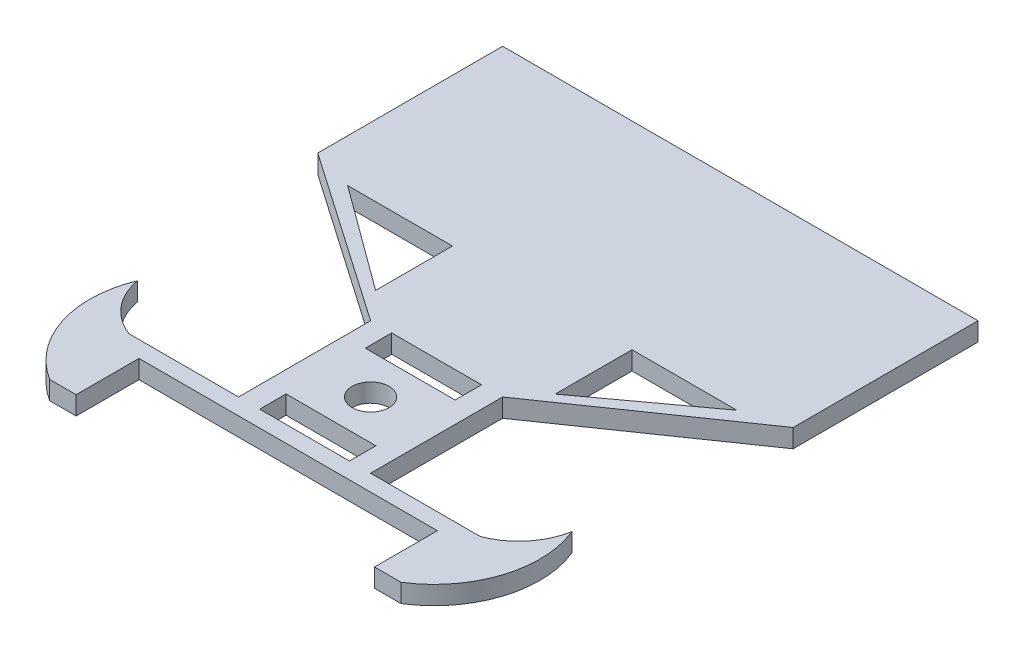
ISO-10303-21;
HEADER;
FILE_DESCRIPTION(('STEP AP214'),'2;1');
FILE_NAME('part.step','',(''),(''),'','','');
FILE_SCHEMA(('AUTOMOTIVE_DESIGN { 1 0 10303 214 1 1 1 1 }'));
ENDSEC;
DATA;
#1=APPLICATION_CONTEXT('core data for automotive mechanical design processes');
#2=APPLICATION_PROTOCOL_DEFINITION('international standard','automotive_design',2000,#1);
#3=PRODUCT_CONTEXT('',#1,'mechanical');
#4=PRODUCT('Part','Part','',(#3));
#5=PRODUCT_RELATED_PRODUCT_CATEGORY('part','',(#4));
#6=PRODUCT_DEFINITION_FORMATION('','',#4);
#7=PRODUCT_DEFINITION_CONTEXT('part definition',#1,'design');
#8=PRODUCT_DEFINITION('design','',#6,#7);
#9=PRODUCT_DEFINITION_SHAPE('','',#8);
#10=(LENGTH_UNIT() NAMED_UNIT(*) SI_UNIT(.MILLI.,.METRE.));
#11=(NAMED_UNIT(*) PLANE_ANGLE_UNIT() SI_UNIT($,.RADIAN.));
#12=(NAMED_UNIT(*) SI_UNIT($,.STERADIAN.) SOLID_ANGLE_UNIT());
#13=UNCERTAINTY_MEASURE_WITH_UNIT(LENGTH_MEASURE(1.E-05),#10,'distance_accuracy_value','');
#14=(GEOMETRIC_REPRESENTATION_CONTEXT(3) GLOBAL_UNCERTAINTY_ASSIGNED_CONTEXT((#13)) GLOBAL_UNIT_ASSIGNED_CONTEXT((#10,
#11,#12)) REPRESENTATION_CONTEXT('',''));
#15=CARTESIAN_POINT('',(0.,0.,0.));
#16=DIRECTION('',(0.,0.,1.));
#17=DIRECTION('',(1.,0.,0.));
#18=AXIS2_PLACEMENT_3D('',#15,#16,#17);
#19=CARTESIAN_POINT('',(-66.5,3.5,195.));
#20=DIRECTION('',(0.,0.,-1.));
#21=DIRECTION('',(-1.,0.,0.));
#22=AXIS2_PLACEMENT_3D('',#19,#20,#21);
#23=PLANE('',#22);
#24=DIRECTION('',(1.,0.,0.));
#25=VECTOR('',#24,1.);
#26=CARTESIAN_POINT('',(-66.5,3.5,195.));
#27=LINE('',#26,#25);
#28=CARTESIAN_POINT('',(56.5,3.5,195.));
#29=VERTEX_POINT('',#28);
#30=CARTESIAN_POINT('',(66.5,3.5,195.));
#31=VERTEX_POINT('',#30);
#32=EDGE_CURVE('E518',#29,#31,#27,.T.);
#33=ORIENTED_EDGE('',*,*,#32,.F.);
#34=DIRECTION('',(0.,1.,0.));
#35=VECTOR('',#34,1.);
#36=CARTESIAN_POINT('',(56.5,-3.5,195.));
#37=LINE('',#36,#35);
#38=CARTESIAN_POINT('',(56.5,-3.5,195.));
#39=VERTEX_POINT('',#38);
#40=EDGE_CURVE('E290',#39,#29,#37,.T.);
#41=ORIENTED_EDGE('',*,*,#40,.F.);
#42=DIRECTION('',(1.,0.,0.));
#43=VECTOR('',#42,1.);
#44=CARTESIAN_POINT('',(-66.5,-3.5,195.));
#45=LINE('',#44,#43);
#46=CARTESIAN_POINT('',(66.5,-3.5,195.));
#47=VERTEX_POINT('',#46);
#48=EDGE_CURVE('E277',#39,#47,#45,.T.);
#49=ORIENTED_EDGE('',*,*,#48,.T.);
#50=DIRECTION('',(0.,-1.,0.));
#51=VECTOR('',#50,1.);
#52=CARTESIAN_POINT('',(66.5,3.5,195.));
#53=LINE('',#52,#51);
#54=EDGE_CURVE('E571',#31,#47,#53,.T.);
#55=ORIENTED_EDGE('',*,*,#54,.F.);
#56=EDGE_LOOP('',(#33,#41,#49,#55));
#57=FACE_BOUND('',#56,.T.);
#58=ADVANCED_FACE('F41',(#57),#23,.F.);
#59=CARTESIAN_POINT('',(0.,3.5,0.));
#60=DIRECTION('',(0.,1.,0.));
#61=DIRECTION('',(0.,0.,1.));
#62=AXIS2_PLACEMENT_3D('',#59,#60,#61);
#63=PLANE('',#62);
#64=DIRECTION('',(0.,0.,-1.));
#65=VECTOR('',#64,1.);
#66=CARTESIAN_POINT('',(56.5,3.5,171.2));
#67=LINE('',#66,#65);
#68=CARTESIAN_POINT('',(56.5,3.5,171.2));
#69=VERTEX_POINT('',#68);
#70=EDGE_CURVE('E257',#29,#69,#67,.T.);
#71=ORIENTED_EDGE('',*,*,#70,.F.);
#72=ORIENTED_EDGE('',*,*,#32,.T.);
#73=CARTESIAN_POINT('',(45.2225000521316,3.5,161.128655238263));
#74=DIRECTION('',(0.,1.,0.));
#75=DIRECTION('',(0.,0.,1.));
#76=AXIS2_PLACEMENT_3D('',#73,#74,#75);
#77=CIRCLE('',#76,40.);
#78=CARTESIAN_POINT('',(82.2688387386572,3.5,146.043271917869));
#79=VERTEX_POINT('',#78);
#80=EDGE_CURVE('E406',#31,#79,#77,.T.);
#81=ORIENTED_EDGE('',*,*,#80,.T.);
#82=CARTESIAN_POINT('',(57.6644436717072,3.5,141.613402462745));
#83=DIRECTION('',(0.,-1.,0.));
#84=DIRECTION('',(0.,0.,1.));
#85=AXIS2_PLACEMENT_3D('',#82,#83,#84);
#86=CIRCLE('',#85,25.);
#87=CARTESIAN_POINT('',(66.5,3.5,165.));
#88=VERTEX_POINT('',#87);
#89=EDGE_CURVE('E462',#79,#88,#86,.T.);
#90=ORIENTED_EDGE('',*,*,#89,.T.);
#91=DIRECTION('',(-1.,0.,0.));
#92=VECTOR('',#91,1.);
#93=CARTESIAN_POINT('',(25.,3.5,165.));
#94=LINE('',#93,#92);
#95=CARTESIAN_POINT('',(25.,3.5,165.));
#96=VERTEX_POINT('',#95);
#97=EDGE_CURVE('E523',#88,#96,#94,.T.);
#98=ORIENTED_EDGE('',*,*,#97,.T.);
#99=DIRECTION('',(0.,0.,-1.));
#100=VECTOR('',#99,1.);
#101=CARTESIAN_POINT('',(25.,3.5,115.));
#102=LINE('',#101,#100);
#103=CARTESIAN_POINT('',(25.,3.5,115.));
#104=VERTEX_POINT('',#103);
#105=EDGE_CURVE('E526',#96,#104,#102,.T.);
#106=ORIENTED_EDGE('',*,*,#105,.T.);
#107=DIRECTION('',(0.822192191643778,0.,-0.569209978830309));
#108=VECTOR('',#107,1.);
#109=CARTESIAN_POINT('',(90.,3.5,70.));
#110=LINE('',#109,#108);
#111=CARTESIAN_POINT('',(90.,3.5,70.));
#112=VERTEX_POINT('',#111);
#113=EDGE_CURVE('E495',#104,#112,#110,.T.);
#114=ORIENTED_EDGE('',*,*,#113,.T.);
#115=DIRECTION('',(0.,0.,-1.));
#116=VECTOR('',#115,1.);
#117=CARTESIAN_POINT('',(90.,3.5,0.));
#118=LINE('',#117,#116);
#119=CARTESIAN_POINT('',(90.,3.5,0.));
#120=VERTEX_POINT('',#119);
#121=EDGE_CURVE('E499',#112,#120,#118,.T.);
#122=ORIENTED_EDGE('',*,*,#121,.T.);
#123=DIRECTION('',(-1.,0.,0.));
#124=VECTOR('',#123,1.);
#125=CARTESIAN_POINT('',(90.,3.5,0.));
#126=LINE('',#125,#124);
#127=CARTESIAN_POINT('',(-90.,3.5,0.));
#128=VERTEX_POINT('',#127);
#129=EDGE_CURVE('E503',#120,#128,#126,.T.);
#130=ORIENTED_EDGE('',*,*,#129,.T.);
#131=DIRECTION('',(0.,0.,1.));
#132=VECTOR('',#131,1.);
#133=CARTESIAN_POINT('',(-90.,3.5,0.));
#134=LINE('',#133,#132);
#135=CARTESIAN_POINT('',(-90.,3.5,70.));
#136=VERTEX_POINT('',#135);
#137=EDGE_CURVE('E506',#128,#136,#134,.T.);
#138=ORIENTED_EDGE('',*,*,#137,.T.);
#139=DIRECTION('',(0.822192191643778,0.,0.569209978830309));
#140=VECTOR('',#139,1.);
#141=CARTESIAN_POINT('',(-90.,3.5,70.));
#142=LINE('',#141,#140);
#143=CARTESIAN_POINT('',(-25.,3.5,115.));
#144=VERTEX_POINT('',#143);
#145=EDGE_CURVE('E509',#136,#144,#142,.T.);
#146=ORIENTED_EDGE('',*,*,#145,.T.);
#147=DIRECTION('',(0.,0.,1.));
#148=VECTOR('',#147,1.);
#149=CARTESIAN_POINT('',(-25.,3.5,115.));
#150=LINE('',#149,#148);
#151=CARTESIAN_POINT('',(-25.,3.5,165.));
#152=VERTEX_POINT('',#151);
#153=EDGE_CURVE('E512',#144,#152,#150,.T.);
#154=ORIENTED_EDGE('',*,*,#153,.T.);
#155=DIRECTION('',(-1.,0.,0.));
#156=VECTOR('',#155,1.);
#157=CARTESIAN_POINT('',(-25.,3.5,165.));
#158=LINE('',#157,#156);
#159=CARTESIAN_POINT('',(-66.5,3.5,165.));
#160=VERTEX_POINT('',#159);
#161=EDGE_CURVE('E515',#152,#160,#158,.T.);
#162=ORIENTED_EDGE('',*,*,#161,.T.);
#163=CARTESIAN_POINT('',(-57.6644436717072,3.5,141.613402462745));
#164=DIRECTION('',(0.,-1.,0.));
#165=DIRECTION('',(0.,0.,-1.));
#166=AXIS2_PLACEMENT_3D('',#163,#164,#165);
#167=CIRCLE('',#166,25.);
#168=CARTESIAN_POINT('',(-82.2688387386573,3.5,146.043271917869));
#169=VERTEX_POINT('',#168);
#170=EDGE_CURVE('E475',#160,#169,#167,.T.);
#171=ORIENTED_EDGE('',*,*,#170,.T.);
#172=CARTESIAN_POINT('',(-45.2225000521316,3.5,161.128655238263));
#173=DIRECTION('',(0.,1.,0.));
#174=DIRECTION('',(0.,0.,-1.));
#175=AXIS2_PLACEMENT_3D('',#172,#173,#174);
#176=CIRCLE('',#175,40.);
#177=CARTESIAN_POINT('',(-66.5,3.5,195.));
#178=VERTEX_POINT('',#177);
#179=EDGE_CURVE('E481',#169,#178,#176,.T.);
#180=ORIENTED_EDGE('',*,*,#179,.T.);
#181=CARTESIAN_POINT('',(-56.5,3.5,195.));
#182=VERTEX_POINT('',#181);
#183=EDGE_CURVE('E519',#178,#182,#27,.T.);
#184=ORIENTED_EDGE('',*,*,#183,.T.);
#185=DIRECTION('',(0.,0.,1.));
#186=VECTOR('',#185,1.);
#187=CARTESIAN_POINT('',(-56.5,3.5,195.));
#188=LINE('',#187,#186);
#189=CARTESIAN_POINT('',(-56.5,3.5,171.2));
#190=VERTEX_POINT('',#189);
#191=EDGE_CURVE('E57',#190,#182,#188,.T.);
#192=ORIENTED_EDGE('',*,*,#191,.F.);
#193=DIRECTION('',(-1.,0.,0.));
#194=VECTOR('',#193,1.);
#195=CARTESIAN_POINT('',(-56.5,3.5,171.2));
#196=LINE('',#195,#194);
#197=EDGE_CURVE('E281',#69,#190,#196,.T.);
#198=ORIENTED_EDGE('',*,*,#197,.F.);
#199=EDGE_LOOP('',(#71,#72,#81,#90,#98,#106,#114,#122,#130,#138,#146,#154,#162,#171,#180,#184,
#192,#198));
#200=FACE_BOUND('',#199,.T.);
#201=DIRECTION('',(0.,0.,-1.));
#202=VECTOR('',#201,1.);
#203=CARTESIAN_POINT('',(-34.,3.5,104.097660067528));
#204=LINE('',#203,#202);
#205=CARTESIAN_POINT('',(-34.,3.5,104.097660067528));
#206=VERTEX_POINT('',#205);
#207=CARTESIAN_POINT('',(-34.,3.5,75.));
#208=VERTEX_POINT('',#207);
#209=EDGE_CURVE('E65',#206,#208,#204,.T.);
#210=ORIENTED_EDGE('',*,*,#209,.F.);
#211=DIRECTION('',(0.806528009731602,0.,0.591195880836784));
#212=VECTOR('',#211,1.);
#213=CARTESIAN_POINT('',(-73.6959427878503,3.5,75.));
#214=LINE('',#213,#212);
#215=CARTESIAN_POINT('',(-73.6959427878503,3.5,75.));
#216=VERTEX_POINT('',#215);
#217=EDGE_CURVE('E304',#216,#206,#214,.T.);
#218=ORIENTED_EDGE('',*,*,#217,.F.);
#219=DIRECTION('',(-1.,0.,0.));
#220=VECTOR('',#219,1.);
#221=CARTESIAN_POINT('',(-34.,3.5,75.));
#222=LINE('',#221,#220);
#223=EDGE_CURVE('E315',#208,#216,#222,.T.);
#224=ORIENTED_EDGE('',*,*,#223,.F.);
#225=EDGE_LOOP('',(#210,#218,#224));
#226=FACE_BOUND('',#225,.T.);
#227=DIRECTION('',(0.806528009731602,0.,-0.591195880836784));
#228=VECTOR('',#227,1.);
#229=CARTESIAN_POINT('',(73.6959427878503,3.5,74.9999999999999));
#230=LINE('',#229,#228);
#231=CARTESIAN_POINT('',(34.,3.5,104.097660067528));
#232=VERTEX_POINT('',#231);
#233=CARTESIAN_POINT('',(73.6959427878503,3.5,74.9999999999999));
#234=VERTEX_POINT('',#233);
#235=EDGE_CURVE('E293',#232,#234,#230,.T.);
#236=ORIENTED_EDGE('',*,*,#235,.F.);
#237=DIRECTION('',(0.,0.,1.));
#238=VECTOR('',#237,1.);
#239=CARTESIAN_POINT('',(34.,3.5,104.097660067528));
#240=LINE('',#239,#238);
#241=CARTESIAN_POINT('',(34.,3.5,74.9999999999999));
#242=VERTEX_POINT('',#241);
#243=EDGE_CURVE('E337',#242,#232,#240,.T.);
#244=ORIENTED_EDGE('',*,*,#243,.F.);
#245=DIRECTION('',(-1.,0.,0.));
#246=VECTOR('',#245,1.);
#247=CARTESIAN_POINT('',(34.,3.5,74.9999999999999));
#248=LINE('',#247,#246);
#249=EDGE_CURVE('E348',#234,#242,#248,.T.);
#250=ORIENTED_EDGE('',*,*,#249,.F.);
#251=EDGE_LOOP('',(#236,#244,#250));
#252=FACE_BOUND('',#251,.T.);
#253=CARTESIAN_POINT('',(0.,3.5,140.));
#254=DIRECTION('',(0.,1.,0.));
#255=DIRECTION('',(0.,0.,1.));
#256=AXIS2_PLACEMENT_3D('',#253,#254,#255);
#257=CIRCLE('',#256,7.);
#258=CARTESIAN_POINT('',(0.,3.5,147.));
#259=VERTEX_POINT('',#258);
#260=EDGE_CURVE('E326',#259,#259,#257,.T.);
#261=ORIENTED_EDGE('',*,*,#260,.F.);
#262=EDGE_LOOP('',(#261));
#263=FACE_BOUND('',#262,.T.);
#264=DIRECTION('',(1.,0.,0.));
#265=VECTOR('',#264,1.);
#266=CARTESIAN_POINT('',(0.,3.5,115.));
#267=LINE('',#266,#265);
#268=CARTESIAN_POINT('',(-17.,3.5,115.));
#269=VERTEX_POINT('',#268);
#270=CARTESIAN_POINT('',(17.,3.5,115.));
#271=VERTEX_POINT('',#270);
#272=EDGE_CURVE('E435',#269,#271,#267,.T.);
#273=ORIENTED_EDGE('',*,*,#272,.T.);
#274=DIRECTION('',(0.,0.,1.));
#275=VECTOR('',#274,1.);
#276=CARTESIAN_POINT('',(16.9999999999999,3.5,0.));
#277=LINE('',#276,#275);
#278=CARTESIAN_POINT('',(17.,3.5,125.));
#279=VERTEX_POINT('',#278);
#280=EDGE_CURVE('E367',#271,#279,#277,.T.);
#281=ORIENTED_EDGE('',*,*,#280,.T.);
#282=DIRECTION('',(1.,0.,0.));
#283=VECTOR('',#282,1.);
#284=CARTESIAN_POINT('',(0.,3.5,125.));
#285=LINE('',#284,#283);
#286=CARTESIAN_POINT('',(-17.,3.5,125.));
#287=VERTEX_POINT('',#286);
#288=EDGE_CURVE('E420',#287,#279,#285,.T.);
#289=ORIENTED_EDGE('',*,*,#288,.F.);
#290=DIRECTION('',(0.,0.,-1.));
#291=VECTOR('',#290,1.);
#292=CARTESIAN_POINT('',(-17.,3.5,0.));
#293=LINE('',#292,#291);
#294=EDGE_CURVE('E439',#287,#269,#293,.T.);
#295=ORIENTED_EDGE('',*,*,#294,.T.);
#296=EDGE_LOOP('',(#273,#281,#289,#295));
#297=FACE_BOUND('',#296,.T.);
#298=DIRECTION('',(1.,0.,0.));
#299=VECTOR('',#298,1.);
#300=CARTESIAN_POINT('',(0.,3.5,155.));
#301=LINE('',#300,#299);
#302=CARTESIAN_POINT('',(-17.,3.5,155.));
#303=VERTEX_POINT('',#302);
#304=CARTESIAN_POINT('',(17.,3.5,155.));
#305=VERTEX_POINT('',#304);
#306=EDGE_CURVE('E391',#303,#305,#301,.T.);
#307=ORIENTED_EDGE('',*,*,#306,.T.);
#308=DIRECTION('',(0.,0.,1.));
#309=VECTOR('',#308,1.);
#310=CARTESIAN_POINT('',(17.,3.5,0.));
#311=LINE('',#310,#309);
#312=CARTESIAN_POINT('',(17.,3.5,165.));
#313=VERTEX_POINT('',#312);
#314=EDGE_CURVE('E387',#305,#313,#311,.T.);
#315=ORIENTED_EDGE('',*,*,#314,.T.);
#316=DIRECTION('',(1.,0.,0.));
#317=VECTOR('',#316,1.);
#318=CARTESIAN_POINT('',(0.,3.5,165.));
#319=LINE('',#318,#317);
#320=CARTESIAN_POINT('',(-17.,3.5,165.));
#321=VERTEX_POINT('',#320);
#322=EDGE_CURVE('E375',#321,#313,#319,.T.);
#323=ORIENTED_EDGE('',*,*,#322,.F.);
#324=DIRECTION('',(0.,0.,1.));
#325=VECTOR('',#324,1.);
#326=CARTESIAN_POINT('',(-17.,3.5,0.));
#327=LINE('',#326,#325);
#328=EDGE_CURVE('E396',#303,#321,#327,.T.);
#329=ORIENTED_EDGE('',*,*,#328,.F.);
#330=EDGE_LOOP('',(#307,#315,#323,#329));
#331=FACE_BOUND('',#330,.T.);
#332=ADVANCED_FACE('F621',(#200,#226,#252,#263,#297,#331),#63,.T.);
#333=CARTESIAN_POINT('',(0.,-3.5,0.));
#334=DIRECTION('',(0.,1.,0.));
#335=DIRECTION('',(0.,0.,1.));
#336=AXIS2_PLACEMENT_3D('',#333,#334,#335);
#337=PLANE('',#336);
#338=ORIENTED_EDGE('',*,*,#48,.F.);
#339=DIRECTION('',(0.,0.,-1.));
#340=VECTOR('',#339,1.);
#341=CARTESIAN_POINT('',(56.5,-3.5,171.2));
#342=LINE('',#341,#340);
#343=CARTESIAN_POINT('',(56.5,-3.5,171.2));
#344=VERTEX_POINT('',#343);
#345=EDGE_CURVE('E254',#39,#344,#342,.T.);
#346=ORIENTED_EDGE('',*,*,#345,.T.);
#347=DIRECTION('',(-1.,0.,0.));
#348=VECTOR('',#347,1.);
#349=CARTESIAN_POINT('',(-56.5,-3.5,171.2));
#350=LINE('',#349,#348);
#351=CARTESIAN_POINT('',(-56.5,-3.5,171.2));
#352=VERTEX_POINT('',#351);
#353=EDGE_CURVE('E266',#344,#352,#350,.T.);
#354=ORIENTED_EDGE('',*,*,#353,.T.);
#355=DIRECTION('',(0.,0.,1.));
#356=VECTOR('',#355,1.);
#357=CARTESIAN_POINT('',(-56.5,-3.5,195.));
#358=LINE('',#357,#356);
#359=CARTESIAN_POINT('',(-56.5,-3.5,195.));
#360=VERTEX_POINT('',#359);
#361=EDGE_CURVE('E263',#352,#360,#358,.T.);
#362=ORIENTED_EDGE('',*,*,#361,.T.);
#363=CARTESIAN_POINT('',(-66.5,-3.5,195.));
#364=VERTEX_POINT('',#363);
#365=EDGE_CURVE('E551',#364,#360,#45,.T.);
#366=ORIENTED_EDGE('',*,*,#365,.F.);
#367=CARTESIAN_POINT('',(-45.2225000521316,-3.5,161.128655238263));
#368=DIRECTION('',(0.,1.,0.));
#369=DIRECTION('',(0.,0.,-1.));
#370=AXIS2_PLACEMENT_3D('',#367,#368,#369);
#371=CIRCLE('',#370,40.);
#372=CARTESIAN_POINT('',(-82.2688387386573,-3.5,146.043271917869));
#373=VERTEX_POINT('',#372);
#374=EDGE_CURVE('E480',#373,#364,#371,.T.);
#375=ORIENTED_EDGE('',*,*,#374,.F.);
#376=CARTESIAN_POINT('',(-57.6644436717072,-3.5,141.613402462745));
#377=DIRECTION('',(0.,-1.,0.));
#378=DIRECTION('',(0.,0.,-1.));
#379=AXIS2_PLACEMENT_3D('',#376,#377,#378);
#380=CIRCLE('',#379,25.);
#381=CARTESIAN_POINT('',(-66.5,-3.5,165.));
#382=VERTEX_POINT('',#381);
#383=EDGE_CURVE('E476',#382,#373,#380,.T.);
#384=ORIENTED_EDGE('',*,*,#383,.F.);
#385=DIRECTION('',(-1.,0.,0.));
#386=VECTOR('',#385,1.);
#387=CARTESIAN_POINT('',(-25.,-3.5,165.));
#388=LINE('',#387,#386);
#389=CARTESIAN_POINT('',(-25.,-3.5,165.));
#390=VERTEX_POINT('',#389);
#391=EDGE_CURVE('E548',#390,#382,#388,.T.);
#392=ORIENTED_EDGE('',*,*,#391,.F.);
#393=DIRECTION('',(0.,0.,1.));
#394=VECTOR('',#393,1.);
#395=CARTESIAN_POINT('',(-25.,-3.5,115.));
#396=LINE('',#395,#394);
#397=CARTESIAN_POINT('',(-25.,-3.5,115.));
#398=VERTEX_POINT('',#397);
#399=EDGE_CURVE('E545',#398,#390,#396,.T.);
#400=ORIENTED_EDGE('',*,*,#399,.F.);
#401=DIRECTION('',(0.822192191643778,0.,0.569209978830309));
#402=VECTOR('',#401,1.);
#403=CARTESIAN_POINT('',(-90.,-3.5,70.));
#404=LINE('',#403,#402);
#405=CARTESIAN_POINT('',(-90.,-3.5,70.));
#406=VERTEX_POINT('',#405);
#407=EDGE_CURVE('E542',#406,#398,#404,.T.);
#408=ORIENTED_EDGE('',*,*,#407,.F.);
#409=DIRECTION('',(0.,0.,1.));
#410=VECTOR('',#409,1.);
#411=CARTESIAN_POINT('',(-90.,-3.5,0.));
#412=LINE('',#411,#410);
#413=CARTESIAN_POINT('',(-90.,-3.5,0.));
#414=VERTEX_POINT('',#413);
#415=EDGE_CURVE('E539',#414,#406,#412,.T.);
#416=ORIENTED_EDGE('',*,*,#415,.F.);
#417=DIRECTION('',(-1.,0.,0.));
#418=VECTOR('',#417,1.);
#419=CARTESIAN_POINT('',(90.,-3.5,0.));
#420=LINE('',#419,#418);
#421=CARTESIAN_POINT('',(90.,-3.5,0.));
#422=VERTEX_POINT('',#421);
#423=EDGE_CURVE('E536',#422,#414,#420,.T.);
#424=ORIENTED_EDGE('',*,*,#423,.F.);
#425=DIRECTION('',(0.,0.,-1.));
#426=VECTOR('',#425,1.);
#427=CARTESIAN_POINT('',(90.,-3.5,0.));
#428=LINE('',#427,#426);
#429=CARTESIAN_POINT('',(90.,-3.5,70.));
#430=VERTEX_POINT('',#429);
#431=EDGE_CURVE('E533',#430,#422,#428,.T.);
#432=ORIENTED_EDGE('',*,*,#431,.F.);
#433=DIRECTION('',(0.822192191643778,0.,-0.569209978830309));
#434=VECTOR('',#433,1.);
#435=CARTESIAN_POINT('',(90.,-3.5,70.));
#436=LINE('',#435,#434);
#437=CARTESIAN_POINT('',(25.,-3.5,115.));
#438=VERTEX_POINT('',#437);
#439=EDGE_CURVE('E494',#438,#430,#436,.T.);
#440=ORIENTED_EDGE('',*,*,#439,.F.);
#441=DIRECTION('',(0.,0.,-1.));
#442=VECTOR('',#441,1.);
#443=CARTESIAN_POINT('',(25.,-3.5,115.));
#444=LINE('',#443,#442);
#445=CARTESIAN_POINT('',(25.,-3.5,165.));
#446=VERTEX_POINT('',#445);
#447=EDGE_CURVE('E500',#446,#438,#444,.T.);
#448=ORIENTED_EDGE('',*,*,#447,.F.);
#449=DIRECTION('',(-1.,0.,0.));
#450=VECTOR('',#449,1.);
#451=CARTESIAN_POINT('',(25.,-3.5,165.));
#452=LINE('',#451,#450);
#453=CARTESIAN_POINT('',(66.5,-3.5,165.));
#454=VERTEX_POINT('',#453);
#455=EDGE_CURVE('E555',#454,#446,#452,.T.);
#456=ORIENTED_EDGE('',*,*,#455,.F.);
#457=CARTESIAN_POINT('',(57.6644436717072,-3.5,141.613402462745));
#458=DIRECTION('',(0.,-1.,0.));
#459=DIRECTION('',(0.,0.,1.));
#460=AXIS2_PLACEMENT_3D('',#457,#458,#459);
#461=CIRCLE('',#460,25.);
#462=CARTESIAN_POINT('',(82.2688387386572,-3.5,146.043271917869));
#463=VERTEX_POINT('',#462);
#464=EDGE_CURVE('E461',#463,#454,#461,.T.);
#465=ORIENTED_EDGE('',*,*,#464,.F.);
#466=CARTESIAN_POINT('',(45.2225000521316,-3.5,161.128655238263));
#467=DIRECTION('',(0.,1.,0.));
#468=DIRECTION('',(0.,0.,1.));
#469=AXIS2_PLACEMENT_3D('',#466,#467,#468);
#470=CIRCLE('',#469,40.);
#471=EDGE_CURVE('E457',#47,#463,#470,.T.);
#472=ORIENTED_EDGE('',*,*,#471,.F.);
#473=EDGE_LOOP('',(#338,#346,#354,#362,#366,#375,#384,#392,#400,#408,#416,#424,#432,#440,#448,
#456,#465,#472));
#474=FACE_BOUND('',#473,.T.);
#475=DIRECTION('',(0.806528009731602,0.,0.591195880836784));
#476=VECTOR('',#475,1.);
#477=CARTESIAN_POINT('',(-73.6959427878503,-3.5,75.));
#478=LINE('',#477,#476);
#479=CARTESIAN_POINT('',(-73.6959427878503,-3.5,75.));
#480=VERTEX_POINT('',#479);
#481=CARTESIAN_POINT('',(-34.,-3.5,104.097660067528));
#482=VERTEX_POINT('',#481);
#483=EDGE_CURVE('E308',#480,#482,#478,.T.);
#484=ORIENTED_EDGE('',*,*,#483,.T.);
#485=DIRECTION('',(0.,0.,-1.));
#486=VECTOR('',#485,1.);
#487=CARTESIAN_POINT('',(-34.,-3.5,104.097660067528));
#488=LINE('',#487,#486);
#489=CARTESIAN_POINT('',(-34.,-3.5,75.));
#490=VERTEX_POINT('',#489);
#491=EDGE_CURVE('E299',#482,#490,#488,.T.);
#492=ORIENTED_EDGE('',*,*,#491,.T.);
#493=DIRECTION('',(-1.,0.,0.));
#494=VECTOR('',#493,1.);
#495=CARTESIAN_POINT('',(-34.,-3.5,75.));
#496=LINE('',#495,#494);
#497=EDGE_CURVE('E303',#490,#480,#496,.T.);
#498=ORIENTED_EDGE('',*,*,#497,.T.);
#499=EDGE_LOOP('',(#484,#492,#498));
#500=FACE_BOUND('',#499,.T.);
#501=DIRECTION('',(0.,0.,1.));
#502=VECTOR('',#501,1.);
#503=CARTESIAN_POINT('',(34.,-3.5,104.097660067528));
#504=LINE('',#503,#502);
#505=CARTESIAN_POINT('',(34.,-3.5,74.9999999999999));
#506=VERTEX_POINT('',#505);
#507=CARTESIAN_POINT('',(34.,-3.5,104.097660067528));
#508=VERTEX_POINT('',#507);
#509=EDGE_CURVE('E341',#506,#508,#504,.T.);
#510=ORIENTED_EDGE('',*,*,#509,.T.);
#511=DIRECTION('',(0.806528009731602,0.,-0.591195880836784));
#512=VECTOR('',#511,1.);
#513=CARTESIAN_POINT('',(73.6959427878503,-3.5,74.9999999999999));
#514=LINE('',#513,#512);
#515=CARTESIAN_POINT('',(73.6959427878503,-3.5,74.9999999999999));
#516=VERTEX_POINT('',#515);
#517=EDGE_CURVE('E332',#508,#516,#514,.T.);
#518=ORIENTED_EDGE('',*,*,#517,.T.);
#519=DIRECTION('',(-1.,0.,0.));
#520=VECTOR('',#519,1.);
#521=CARTESIAN_POINT('',(34.,-3.5,74.9999999999999));
#522=LINE('',#521,#520);
#523=EDGE_CURVE('E336',#516,#506,#522,.T.);
#524=ORIENTED_EDGE('',*,*,#523,.T.);
#525=EDGE_LOOP('',(#510,#518,#524));
#526=FACE_BOUND('',#525,.T.);
#527=CARTESIAN_POINT('',(0.,-3.5,140.));
#528=DIRECTION('',(0.,1.,0.));
#529=DIRECTION('',(0.,0.,1.));
#530=AXIS2_PLACEMENT_3D('',#527,#528,#529);
#531=CIRCLE('',#530,7.);
#532=CARTESIAN_POINT('',(0.,-3.5,147.));
#533=VERTEX_POINT('',#532);
#534=EDGE_CURVE('E363',#533,#533,#531,.T.);
#535=ORIENTED_EDGE('',*,*,#534,.T.);
#536=EDGE_LOOP('',(#535));
#537=FACE_BOUND('',#536,.T.);
#538=DIRECTION('',(0.,0.,1.));
#539=VECTOR('',#538,1.);
#540=CARTESIAN_POINT('',(16.9999999999999,-3.5,0.));
#541=LINE('',#540,#539);
#542=CARTESIAN_POINT('',(17.,-3.5,115.));
#543=VERTEX_POINT('',#542);
#544=CARTESIAN_POINT('',(17.,-3.5,125.));
#545=VERTEX_POINT('',#544);
#546=EDGE_CURVE('E416',#543,#545,#541,.T.);
#547=ORIENTED_EDGE('',*,*,#546,.F.);
#548=DIRECTION('',(1.,0.,0.));
#549=VECTOR('',#548,1.);
#550=CARTESIAN_POINT('',(0.,-3.5,115.));
#551=LINE('',#550,#549);
#552=CARTESIAN_POINT('',(-17.,-3.5,115.));
#553=VERTEX_POINT('',#552);
#554=EDGE_CURVE('E419',#553,#543,#551,.T.);
#555=ORIENTED_EDGE('',*,*,#554,.F.);
#556=DIRECTION('',(0.,0.,-1.));
#557=VECTOR('',#556,1.);
#558=CARTESIAN_POINT('',(-17.,-3.5,0.));
#559=LINE('',#558,#557);
#560=CARTESIAN_POINT('',(-17.,-3.5,125.));
#561=VERTEX_POINT('',#560);
#562=EDGE_CURVE('E423',#561,#553,#559,.T.);
#563=ORIENTED_EDGE('',*,*,#562,.F.);
#564=DIRECTION('',(1.,0.,0.));
#565=VECTOR('',#564,1.);
#566=CARTESIAN_POINT('',(0.,-3.5,125.));
#567=LINE('',#566,#565);
#568=EDGE_CURVE('E427',#561,#545,#567,.T.);
#569=ORIENTED_EDGE('',*,*,#568,.T.);
#570=EDGE_LOOP('',(#547,#555,#563,#569));
#571=FACE_BOUND('',#570,.T.);
#572=DIRECTION('',(0.,0.,1.));
#573=VECTOR('',#572,1.);
#574=CARTESIAN_POINT('',(17.,-3.5,0.));
#575=LINE('',#574,#573);
#576=CARTESIAN_POINT('',(17.,-3.5,155.));
#577=VERTEX_POINT('',#576);
#578=CARTESIAN_POINT('',(17.,-3.5,165.));
#579=VERTEX_POINT('',#578);
#580=EDGE_CURVE('E371',#577,#579,#575,.T.);
#581=ORIENTED_EDGE('',*,*,#580,.F.);
#582=DIRECTION('',(1.,0.,0.));
#583=VECTOR('',#582,1.);
#584=CARTESIAN_POINT('',(0.,-3.5,155.));
#585=LINE('',#584,#583);
#586=CARTESIAN_POINT('',(-17.,-3.5,155.));
#587=VERTEX_POINT('',#586);
#588=EDGE_CURVE('E374',#587,#577,#585,.T.);
#589=ORIENTED_EDGE('',*,*,#588,.F.);
#590=DIRECTION('',(0.,0.,1.));
#591=VECTOR('',#590,1.);
#592=CARTESIAN_POINT('',(-17.,-3.5,0.));
#593=LINE('',#592,#591);
#594=CARTESIAN_POINT('',(-17.,-3.5,165.));
#595=VERTEX_POINT('',#594);
#596=EDGE_CURVE('E378',#587,#595,#593,.T.);
#597=ORIENTED_EDGE('',*,*,#596,.T.);
#598=DIRECTION('',(1.,0.,0.));
#599=VECTOR('',#598,1.);
#600=CARTESIAN_POINT('',(0.,-3.5,165.));
#601=LINE('',#600,#599);
#602=EDGE_CURVE('E382',#595,#579,#601,.T.);
#603=ORIENTED_EDGE('',*,*,#602,.T.);
#604=EDGE_LOOP('',(#581,#589,#597,#603));
#605=FACE_BOUND('',#604,.T.);
#606=ADVANCED_FACE('F274',(#474,#500,#526,#537,#571,#605),#337,.F.);
#607=CARTESIAN_POINT('',(90.,3.5,70.));
#608=DIRECTION('',(-0.569209978830309,0.,-0.822192191643778));
#609=DIRECTION('',(-0.822192191643778,0.,0.569209978830309));
#610=AXIS2_PLACEMENT_3D('',#607,#608,#609);
#611=PLANE('',#610);
#612=ORIENTED_EDGE('',*,*,#439,.T.);
#613=DIRECTION('',(0.,-1.,0.));
#614=VECTOR('',#613,1.);
#615=CARTESIAN_POINT('',(90.,3.5,70.));
#616=LINE('',#615,#614);
#617=EDGE_CURVE('E11',#112,#430,#616,.T.);
#618=ORIENTED_EDGE('',*,*,#617,.F.);
#619=ORIENTED_EDGE('',*,*,#113,.F.);
#620=DIRECTION('',(0.,-1.,0.));
#621=VECTOR('',#620,1.);
#622=CARTESIAN_POINT('',(25.,3.5,115.));
#623=LINE('',#622,#621);
#624=EDGE_CURVE('E529',#104,#438,#623,.T.);
#625=ORIENTED_EDGE('',*,*,#624,.T.);
#626=EDGE_LOOP('',(#612,#618,#619,#625));
#627=FACE_BOUND('',#626,.T.);
#628=ADVANCED_FACE('F43',(#627),#611,.F.);
#629=CARTESIAN_POINT('',(90.,3.5,0.));
#630=DIRECTION('',(-1.,0.,0.));
#631=DIRECTION('',(0.,0.,1.));
#632=AXIS2_PLACEMENT_3D('',#629,#630,#631);
#633=PLANE('',#632);
#634=ORIENTED_EDGE('',*,*,#431,.T.);
#635=DIRECTION('',(0.,-1.,0.));
#636=VECTOR('',#635,1.);
#637=CARTESIAN_POINT('',(90.,3.5,0.));
#638=LINE('',#637,#636);
#639=EDGE_CURVE('E50',#120,#422,#638,.T.);
#640=ORIENTED_EDGE('',*,*,#639,.F.);
#641=ORIENTED_EDGE('',*,*,#121,.F.);
#642=ORIENTED_EDGE('',*,*,#617,.T.);
#643=EDGE_LOOP('',(#634,#640,#641,#642));
#644=FACE_BOUND('',#643,.T.);
#645=ADVANCED_FACE('F626',(#644),#633,.F.);
#646=CARTESIAN_POINT('',(90.,3.5,0.));
#647=DIRECTION('',(0.,0.,1.));
#648=DIRECTION('',(1.,0.,0.));
#649=AXIS2_PLACEMENT_3D('',#646,#647,#648);
#650=PLANE('',#649);
#651=ORIENTED_EDGE('',*,*,#423,.T.);
#652=DIRECTION('',(0.,-1.,0.));
#653=VECTOR('',#652,1.);
#654=CARTESIAN_POINT('',(-90.,3.5,0.));
#655=LINE('',#654,#653);
#656=EDGE_CURVE('E595',#128,#414,#655,.T.);
#657=ORIENTED_EDGE('',*,*,#656,.F.);
#658=ORIENTED_EDGE('',*,*,#129,.F.);
#659=ORIENTED_EDGE('',*,*,#639,.T.);
#660=EDGE_LOOP('',(#651,#657,#658,#659));
#661=FACE_BOUND('',#660,.T.);
#662=ADVANCED_FACE('F604',(#661),#650,.F.);
#663=CARTESIAN_POINT('',(-90.,3.5,0.));
#664=DIRECTION('',(1.,0.,0.));
#665=DIRECTION('',(0.,0.,-1.));
#666=AXIS2_PLACEMENT_3D('',#663,#664,#665);
#667=PLANE('',#666);
#668=ORIENTED_EDGE('',*,*,#415,.T.);
#669=DIRECTION('',(0.,-1.,0.));
#670=VECTOR('',#669,1.);
#671=CARTESIAN_POINT('',(-90.,3.5,70.));
#672=LINE('',#671,#670);
#673=EDGE_CURVE('E591',#136,#406,#672,.T.);
#674=ORIENTED_EDGE('',*,*,#673,.F.);
#675=ORIENTED_EDGE('',*,*,#137,.F.);
#676=ORIENTED_EDGE('',*,*,#656,.T.);
#677=EDGE_LOOP('',(#668,#674,#675,#676));
#678=FACE_BOUND('',#677,.T.);
#679=ADVANCED_FACE('F613',(#678),#667,.F.);
#680=CARTESIAN_POINT('',(-90.,3.5,70.));
#681=DIRECTION('',(0.569209978830309,0.,-0.822192191643778));
#682=DIRECTION('',(-0.822192191643778,0.,-0.569209978830309));
#683=AXIS2_PLACEMENT_3D('',#680,#681,#682);
#684=PLANE('',#683);
#685=ORIENTED_EDGE('',*,*,#407,.T.);
#686=DIRECTION('',(0.,-1.,0.));
#687=VECTOR('',#686,1.);
#688=CARTESIAN_POINT('',(-25.,3.5,115.));
#689=LINE('',#688,#687);
#690=EDGE_CURVE('E587',#144,#398,#689,.T.);
#691=ORIENTED_EDGE('',*,*,#690,.F.);
#692=ORIENTED_EDGE('',*,*,#145,.F.);
#693=ORIENTED_EDGE('',*,*,#673,.T.);
#694=EDGE_LOOP('',(#685,#691,#692,#693));
#695=FACE_BOUND('',#694,.T.);
#696=ADVANCED_FACE('F617',(#695),#684,.F.);
#697=CARTESIAN_POINT('',(-25.,3.5,115.));
#698=DIRECTION('',(1.,0.,0.));
#699=DIRECTION('',(0.,0.,-1.));
#700=AXIS2_PLACEMENT_3D('',#697,#698,#699);
#701=PLANE('',#700);
#702=ORIENTED_EDGE('',*,*,#399,.T.);
#703=DIRECTION('',(0.,-1.,0.));
#704=VECTOR('',#703,1.);
#705=CARTESIAN_POINT('',(-25.,3.5,165.));
#706=LINE('',#705,#704);
#707=EDGE_CURVE('E583',#152,#390,#706,.T.);
#708=ORIENTED_EDGE('',*,*,#707,.F.);
#709=ORIENTED_EDGE('',*,*,#153,.F.);
#710=ORIENTED_EDGE('',*,*,#690,.T.);
#711=EDGE_LOOP('',(#702,#708,#709,#710));
#712=FACE_BOUND('',#711,.T.);
#713=ADVANCED_FACE('F666',(#712),#701,.F.);
#714=CARTESIAN_POINT('',(-25.,3.5,165.));
#715=DIRECTION('',(0.,0.,1.));
#716=DIRECTION('',(1.,0.,0.));
#717=AXIS2_PLACEMENT_3D('',#714,#715,#716);
#718=PLANE('',#717);
#719=ORIENTED_EDGE('',*,*,#391,.T.);
#720=DIRECTION('',(0.,-1.,0.));
#721=VECTOR('',#720,1.);
#722=CARTESIAN_POINT('',(-66.5,3.5,165.));
#723=LINE('',#722,#721);
#724=EDGE_CURVE('E579',#160,#382,#723,.T.);
#725=ORIENTED_EDGE('',*,*,#724,.F.);
#726=ORIENTED_EDGE('',*,*,#161,.F.);
#727=ORIENTED_EDGE('',*,*,#707,.T.);
#728=EDGE_LOOP('',(#719,#725,#726,#727));
#729=FACE_BOUND('',#728,.T.);
#730=ADVANCED_FACE('F664',(#729),#718,.F.);
#731=ORIENTED_EDGE('',*,*,#365,.T.);
#732=DIRECTION('',(0.,1.,0.));
#733=VECTOR('',#732,1.);
#734=CARTESIAN_POINT('',(-56.5,-3.5,195.));
#735=LINE('',#734,#733);
#736=EDGE_CURVE('E294',#360,#182,#735,.T.);
#737=ORIENTED_EDGE('',*,*,#736,.T.);
#738=ORIENTED_EDGE('',*,*,#183,.F.);
#739=DIRECTION('',(0.,-1.,0.));
#740=VECTOR('',#739,1.);
#741=CARTESIAN_POINT('',(-66.5,3.5,195.));
#742=LINE('',#741,#740);
#743=EDGE_CURVE('E575',#178,#364,#742,.T.);
#744=ORIENTED_EDGE('',*,*,#743,.T.);
#745=EDGE_LOOP('',(#731,#737,#738,#744));
#746=FACE_BOUND('',#745,.T.);
#747=ADVANCED_FACE('F652',(#746),#23,.F.);
#748=CARTESIAN_POINT('',(25.,3.5,165.));
#749=DIRECTION('',(0.,0.,1.));
#750=DIRECTION('',(1.,0.,0.));
#751=AXIS2_PLACEMENT_3D('',#748,#749,#750);
#752=PLANE('',#751);
#753=ORIENTED_EDGE('',*,*,#455,.T.);
#754=DIRECTION('',(0.,-1.,0.));
#755=VECTOR('',#754,1.);
#756=CARTESIAN_POINT('',(25.,3.5,165.));
#757=LINE('',#756,#755);
#758=EDGE_CURVE('E563',#96,#446,#757,.T.);
#759=ORIENTED_EDGE('',*,*,#758,.F.);
#760=ORIENTED_EDGE('',*,*,#97,.F.);
#761=DIRECTION('',(0.,-1.,0.));
#762=VECTOR('',#761,1.);
#763=CARTESIAN_POINT('',(66.5,3.5,165.));
#764=LINE('',#763,#762);
#765=EDGE_CURVE('E567',#88,#454,#764,.T.);
#766=ORIENTED_EDGE('',*,*,#765,.T.);
#767=EDGE_LOOP('',(#753,#759,#760,#766));
#768=FACE_BOUND('',#767,.T.);
#769=ADVANCED_FACE('F636',(#768),#752,.F.);
#770=CARTESIAN_POINT('',(25.,3.5,115.));
#771=DIRECTION('',(-1.,0.,0.));
#772=DIRECTION('',(0.,0.,1.));
#773=AXIS2_PLACEMENT_3D('',#770,#771,#772);
#774=PLANE('',#773);
#775=ORIENTED_EDGE('',*,*,#447,.T.);
#776=ORIENTED_EDGE('',*,*,#624,.F.);
#777=ORIENTED_EDGE('',*,*,#105,.F.);
#778=ORIENTED_EDGE('',*,*,#758,.T.);
#779=EDGE_LOOP('',(#775,#776,#777,#778));
#780=FACE_BOUND('',#779,.T.);
#781=ADVANCED_FACE('F632',(#780),#774,.F.);
#782=CARTESIAN_POINT('',(-57.6644436717072,-3.5,141.613402462745));
#783=DIRECTION('',(0.,1.,0.));
#784=DIRECTION('',(0.,0.,1.));
#785=AXIS2_PLACEMENT_3D('',#782,#783,#784);
#786=CYLINDRICAL_SURFACE('',#785,25.);
#787=ORIENTED_EDGE('',*,*,#170,.F.);
#788=ORIENTED_EDGE('',*,*,#724,.T.);
#789=ORIENTED_EDGE('',*,*,#383,.T.);
#790=DIRECTION('',(0.,1.,0.));
#791=VECTOR('',#790,1.);
#792=CARTESIAN_POINT('',(-82.2688387386573,-3.5,146.043271917869));
#793=LINE('',#792,#791);
#794=EDGE_CURVE('E485',#373,#169,#793,.T.);
#795=ORIENTED_EDGE('',*,*,#794,.T.);
#796=EDGE_LOOP('',(#787,#788,#789,#795));
#797=FACE_BOUND('',#796,.T.);
#798=ADVANCED_FACE('F660',(#797),#786,.F.);
#799=CARTESIAN_POINT('',(-45.2225000521316,-3.5,161.128655238263));
#800=DIRECTION('',(0.,1.,0.));
#801=DIRECTION('',(0.,0.,1.));
#802=AXIS2_PLACEMENT_3D('',#799,#800,#801);
#803=CYLINDRICAL_SURFACE('',#802,40.);
#804=ORIENTED_EDGE('',*,*,#179,.F.);
#805=ORIENTED_EDGE('',*,*,#794,.F.);
#806=ORIENTED_EDGE('',*,*,#374,.T.);
#807=ORIENTED_EDGE('',*,*,#743,.F.);
#808=EDGE_LOOP('',(#804,#805,#806,#807));
#809=FACE_BOUND('',#808,.T.);
#810=ADVANCED_FACE('F654',(#809),#803,.T.);
#811=CARTESIAN_POINT('',(45.2225000521316,-3.5,161.128655238263));
#812=DIRECTION('',(0.,1.,0.));
#813=DIRECTION('',(0.,0.,1.));
#814=AXIS2_PLACEMENT_3D('',#811,#812,#813);
#815=CYLINDRICAL_SURFACE('',#814,40.);
#816=ORIENTED_EDGE('',*,*,#80,.F.);
#817=ORIENTED_EDGE('',*,*,#54,.T.);
#818=ORIENTED_EDGE('',*,*,#471,.T.);
#819=DIRECTION('',(0.,1.,0.));
#820=VECTOR('',#819,1.);
#821=CARTESIAN_POINT('',(82.2688387386572,-3.5,146.043271917869));
#822=LINE('',#821,#820);
#823=EDGE_CURVE('E466',#463,#79,#822,.T.);
#824=ORIENTED_EDGE('',*,*,#823,.T.);
#825=EDGE_LOOP('',(#816,#817,#818,#824));
#826=FACE_BOUND('',#825,.T.);
#827=ADVANCED_FACE('F643',(#826),#815,.T.);
#828=CARTESIAN_POINT('',(57.6644436717072,-3.5,141.613402462745));
#829=DIRECTION('',(0.,1.,0.));
#830=DIRECTION('',(0.,0.,1.));
#831=AXIS2_PLACEMENT_3D('',#828,#829,#830);
#832=CYLINDRICAL_SURFACE('',#831,25.);
#833=ORIENTED_EDGE('',*,*,#89,.F.);
#834=ORIENTED_EDGE('',*,*,#823,.F.);
#835=ORIENTED_EDGE('',*,*,#464,.T.);
#836=ORIENTED_EDGE('',*,*,#765,.F.);
#837=EDGE_LOOP('',(#833,#834,#835,#836));
#838=FACE_BOUND('',#837,.T.);
#839=ADVANCED_FACE('F640',(#838),#832,.F.);
#840=CARTESIAN_POINT('',(16.9999999999999,-3.5,0.));
#841=DIRECTION('',(-1.,0.,0.));
#842=DIRECTION('',(0.,0.,1.));
#843=AXIS2_PLACEMENT_3D('',#840,#841,#842);
#844=PLANE('',#843);
#845=ORIENTED_EDGE('',*,*,#280,.F.);
#846=DIRECTION('',(0.,1.,0.));
#847=VECTOR('',#846,1.);
#848=CARTESIAN_POINT('',(17.,-3.5,115.));
#849=LINE('',#848,#847);
#850=EDGE_CURVE('E431',#543,#271,#849,.T.);
#851=ORIENTED_EDGE('',*,*,#850,.F.);
#852=ORIENTED_EDGE('',*,*,#546,.T.);
#853=DIRECTION('',(0.,1.,0.));
#854=VECTOR('',#853,1.);
#855=CARTESIAN_POINT('',(17.,-3.5,125.));
#856=LINE('',#855,#854);
#857=EDGE_CURVE('E392',#545,#279,#856,.T.);
#858=ORIENTED_EDGE('',*,*,#857,.T.);
#859=EDGE_LOOP('',(#845,#851,#852,#858));
#860=FACE_BOUND('',#859,.T.);
#861=ADVANCED_FACE('F701',(#860),#844,.T.);
#862=CARTESIAN_POINT('',(0.,-3.5,125.));
#863=DIRECTION('',(0.,0.,1.));
#864=DIRECTION('',(1.,0.,0.));
#865=AXIS2_PLACEMENT_3D('',#862,#863,#864);
#866=PLANE('',#865);
#867=ORIENTED_EDGE('',*,*,#288,.T.);
#868=ORIENTED_EDGE('',*,*,#857,.F.);
#869=ORIENTED_EDGE('',*,*,#568,.F.);
#870=DIRECTION('',(0.,1.,0.));
#871=VECTOR('',#870,1.);
#872=CARTESIAN_POINT('',(-17.,-3.5,125.));
#873=LINE('',#872,#871);
#874=EDGE_CURVE('E448',#561,#287,#873,.T.);
#875=ORIENTED_EDGE('',*,*,#874,.T.);
#876=EDGE_LOOP('',(#867,#868,#869,#875));
#877=FACE_BOUND('',#876,.T.);
#878=ADVANCED_FACE('F704',(#877),#866,.F.);
#879=CARTESIAN_POINT('',(-17.,-3.5,0.));
#880=DIRECTION('',(1.,0.,0.));
#881=DIRECTION('',(0.,0.,-1.));
#882=AXIS2_PLACEMENT_3D('',#879,#880,#881);
#883=PLANE('',#882);
#884=ORIENTED_EDGE('',*,*,#294,.F.);
#885=ORIENTED_EDGE('',*,*,#874,.F.);
#886=ORIENTED_EDGE('',*,*,#562,.T.);
#887=DIRECTION('',(0.,1.,0.));
#888=VECTOR('',#887,1.);
#889=CARTESIAN_POINT('',(-17.,-3.5,115.));
#890=LINE('',#889,#888);
#891=EDGE_CURVE('E451',#553,#269,#890,.T.);
#892=ORIENTED_EDGE('',*,*,#891,.T.);
#893=EDGE_LOOP('',(#884,#885,#886,#892));
#894=FACE_BOUND('',#893,.T.);
#895=ADVANCED_FACE('F710',(#894),#883,.T.);
#896=CARTESIAN_POINT('',(0.,-3.5,115.));
#897=DIRECTION('',(0.,0.,1.));
#898=DIRECTION('',(1.,0.,0.));
#899=AXIS2_PLACEMENT_3D('',#896,#897,#898);
#900=PLANE('',#899);
#901=ORIENTED_EDGE('',*,*,#272,.F.);
#902=ORIENTED_EDGE('',*,*,#891,.F.);
#903=ORIENTED_EDGE('',*,*,#554,.T.);
#904=ORIENTED_EDGE('',*,*,#850,.T.);
#905=EDGE_LOOP('',(#901,#902,#903,#904));
#906=FACE_BOUND('',#905,.T.);
#907=ADVANCED_FACE('F706',(#906),#900,.T.);
#908=CARTESIAN_POINT('',(17.,-3.5,0.));
#909=DIRECTION('',(-1.,0.,0.));
#910=DIRECTION('',(0.,0.,1.));
#911=AXIS2_PLACEMENT_3D('',#908,#909,#910);
#912=PLANE('',#911);
#913=ORIENTED_EDGE('',*,*,#314,.F.);
#914=DIRECTION('',(0.,1.,0.));
#915=VECTOR('',#914,1.);
#916=CARTESIAN_POINT('',(17.,-3.5,155.));
#917=LINE('',#916,#915);
#918=EDGE_CURVE('E386',#577,#305,#917,.T.);
#919=ORIENTED_EDGE('',*,*,#918,.F.);
#920=ORIENTED_EDGE('',*,*,#580,.T.);
#921=DIRECTION('',(0.,1.,0.));
#922=VECTOR('',#921,1.);
#923=CARTESIAN_POINT('',(17.,-3.5,165.));
#924=LINE('',#923,#922);
#925=EDGE_CURVE('E403',#579,#313,#924,.T.);
#926=ORIENTED_EDGE('',*,*,#925,.T.);
#927=EDGE_LOOP('',(#913,#919,#920,#926));
#928=FACE_BOUND('',#927,.T.);
#929=ADVANCED_FACE('F709',(#928),#912,.T.);
#930=CARTESIAN_POINT('',(0.,-3.5,165.));
#931=DIRECTION('',(0.,0.,1.));
#932=DIRECTION('',(1.,0.,0.));
#933=AXIS2_PLACEMENT_3D('',#930,#931,#932);
#934=PLANE('',#933);
#935=ORIENTED_EDGE('',*,*,#322,.T.);
#936=ORIENTED_EDGE('',*,*,#925,.F.);
#937=ORIENTED_EDGE('',*,*,#602,.F.);
#938=DIRECTION('',(0.,1.,0.));
#939=VECTOR('',#938,1.);
#940=CARTESIAN_POINT('',(-17.,-3.5,165.));
#941=LINE('',#940,#939);
#942=EDGE_CURVE('E407',#595,#321,#941,.T.);
#943=ORIENTED_EDGE('',*,*,#942,.T.);
#944=EDGE_LOOP('',(#935,#936,#937,#943));
#945=FACE_BOUND('',#944,.T.);
#946=ADVANCED_FACE('F720',(#945),#934,.F.);
#947=CARTESIAN_POINT('',(-17.,-3.5,0.));
#948=DIRECTION('',(-1.,0.,0.));
#949=DIRECTION('',(0.,0.,1.));
#950=AXIS2_PLACEMENT_3D('',#947,#948,#949);
#951=PLANE('',#950);
#952=ORIENTED_EDGE('',*,*,#328,.T.);
#953=ORIENTED_EDGE('',*,*,#942,.F.);
#954=ORIENTED_EDGE('',*,*,#596,.F.);
#955=DIRECTION('',(0.,1.,0.));
#956=VECTOR('',#955,1.);
#957=CARTESIAN_POINT('',(-17.,-3.5,155.));
#958=LINE('',#957,#956);
#959=EDGE_CURVE('E410',#587,#303,#958,.T.);
#960=ORIENTED_EDGE('',*,*,#959,.T.);
#961=EDGE_LOOP('',(#952,#953,#954,#960));
#962=FACE_BOUND('',#961,.T.);
#963=ADVANCED_FACE('F726',(#962),#951,.F.);
#964=CARTESIAN_POINT('',(0.,-3.5,155.));
#965=DIRECTION('',(0.,0.,1.));
#966=DIRECTION('',(1.,0.,0.));
#967=AXIS2_PLACEMENT_3D('',#964,#965,#966);
#968=PLANE('',#967);
#969=ORIENTED_EDGE('',*,*,#306,.F.);
#970=ORIENTED_EDGE('',*,*,#959,.F.);
#971=ORIENTED_EDGE('',*,*,#588,.T.);
#972=ORIENTED_EDGE('',*,*,#918,.T.);
#973=EDGE_LOOP('',(#969,#970,#971,#972));
#974=FACE_BOUND('',#973,.T.);
#975=ADVANCED_FACE('F722',(#974),#968,.T.);
#976=CARTESIAN_POINT('',(0.,-3.5,140.));
#977=DIRECTION('',(0.,1.,0.));
#978=DIRECTION('',(0.,0.,1.));
#979=AXIS2_PLACEMENT_3D('',#976,#977,#978);
#980=CYLINDRICAL_SURFACE('',#979,7.);
#981=ORIENTED_EDGE('',*,*,#534,.F.);
#982=EDGE_LOOP('',(#981));
#983=FACE_BOUND('',#982,.T.);
#984=ORIENTED_EDGE('',*,*,#260,.T.);
#985=EDGE_LOOP('',(#984));
#986=FACE_BOUND('',#985,.T.);
#987=ADVANCED_FACE('F725',(#983,#986),#980,.F.);
#988=CARTESIAN_POINT('',(73.6959427878503,-3.5,74.9999999999999));
#989=DIRECTION('',(0.591195880836784,0.,0.806528009731602));
#990=DIRECTION('',(0.806528009731602,0.,-0.591195880836784));
#991=AXIS2_PLACEMENT_3D('',#988,#989,#990);
#992=PLANE('',#991);
#993=ORIENTED_EDGE('',*,*,#235,.T.);
#994=DIRECTION('',(0.,1.,0.));
#995=VECTOR('',#994,1.);
#996=CARTESIAN_POINT('',(73.6959427878503,-3.5,74.9999999999999));
#997=LINE('',#996,#995);
#998=EDGE_CURVE('E345',#516,#234,#997,.T.);
#999=ORIENTED_EDGE('',*,*,#998,.F.);
#1000=ORIENTED_EDGE('',*,*,#517,.F.);
#1001=DIRECTION('',(0.,1.,0.));
#1002=VECTOR('',#1001,1.);
#1003=CARTESIAN_POINT('',(34.,-3.5,104.097660067528));
#1004=LINE('',#1003,#1002);
#1005=EDGE_CURVE('E316',#508,#232,#1004,.T.);
#1006=ORIENTED_EDGE('',*,*,#1005,.T.);
#1007=EDGE_LOOP('',(#993,#999,#1000,#1006));
#1008=FACE_BOUND('',#1007,.T.);
#1009=ADVANCED_FACE('F736',(#1008),#992,.F.);
#1010=CARTESIAN_POINT('',(34.,-3.5,104.097660067528));
#1011=DIRECTION('',(-1.,0.,0.));
#1012=DIRECTION('',(0.,0.,1.));
#1013=AXIS2_PLACEMENT_3D('',#1010,#1011,#1012);
#1014=PLANE('',#1013);
#1015=ORIENTED_EDGE('',*,*,#243,.T.);
#1016=ORIENTED_EDGE('',*,*,#1005,.F.);
#1017=ORIENTED_EDGE('',*,*,#509,.F.);
#1018=DIRECTION('',(0.,1.,0.));
#1019=VECTOR('',#1018,1.);
#1020=CARTESIAN_POINT('',(34.,-3.5,74.9999999999999));
#1021=LINE('',#1020,#1019);
#1022=EDGE_CURVE('E357',#506,#242,#1021,.T.);
#1023=ORIENTED_EDGE('',*,*,#1022,.T.);
#1024=EDGE_LOOP('',(#1015,#1016,#1017,#1023));
#1025=FACE_BOUND('',#1024,.T.);
#1026=ADVANCED_FACE('F740',(#1025),#1014,.F.);
#1027=CARTESIAN_POINT('',(34.,-3.5,74.9999999999999));
#1028=DIRECTION('',(0.,0.,-1.));
#1029=DIRECTION('',(-1.,0.,0.));
#1030=AXIS2_PLACEMENT_3D('',#1027,#1028,#1029);
#1031=PLANE('',#1030);
#1032=ORIENTED_EDGE('',*,*,#249,.T.);
#1033=ORIENTED_EDGE('',*,*,#1022,.F.);
#1034=ORIENTED_EDGE('',*,*,#523,.F.);
#1035=ORIENTED_EDGE('',*,*,#998,.T.);
#1036=EDGE_LOOP('',(#1032,#1033,#1034,#1035));
#1037=FACE_BOUND('',#1036,.T.);
#1038=ADVANCED_FACE('F742',(#1037),#1031,.F.);
#1039=CARTESIAN_POINT('',(-34.,-3.5,104.097660067528));
#1040=DIRECTION('',(1.,0.,0.));
#1041=DIRECTION('',(0.,0.,-1.));
#1042=AXIS2_PLACEMENT_3D('',#1039,#1040,#1041);
#1043=PLANE('',#1042);
#1044=ORIENTED_EDGE('',*,*,#209,.T.);
#1045=DIRECTION('',(0.,1.,0.));
#1046=VECTOR('',#1045,1.);
#1047=CARTESIAN_POINT('',(-34.,-3.5,75.));
#1048=LINE('',#1047,#1046);
#1049=EDGE_CURVE('E312',#490,#208,#1048,.T.);
#1050=ORIENTED_EDGE('',*,*,#1049,.F.);
#1051=ORIENTED_EDGE('',*,*,#491,.F.);
#1052=DIRECTION('',(0.,1.,0.));
#1053=VECTOR('',#1052,1.);
#1054=CARTESIAN_POINT('',(-34.,-3.5,104.097660067528));
#1055=LINE('',#1054,#1053);
#1056=EDGE_CURVE('E323',#482,#206,#1055,.T.);
#1057=ORIENTED_EDGE('',*,*,#1056,.T.);
#1058=EDGE_LOOP('',(#1044,#1050,#1051,#1057));
#1059=FACE_BOUND('',#1058,.T.);
#1060=ADVANCED_FACE('F745',(#1059),#1043,.F.);
#1061=CARTESIAN_POINT('',(-73.6959427878503,-3.5,75.));
#1062=DIRECTION('',(-0.591195880836784,0.,0.806528009731602));
#1063=DIRECTION('',(0.806528009731602,0.,0.591195880836784));
#1064=AXIS2_PLACEMENT_3D('',#1061,#1062,#1063);
#1065=PLANE('',#1064);
#1066=ORIENTED_EDGE('',*,*,#217,.T.);
#1067=ORIENTED_EDGE('',*,*,#1056,.F.);
#1068=ORIENTED_EDGE('',*,*,#483,.F.);
#1069=DIRECTION('',(0.,1.,0.));
#1070=VECTOR('',#1069,1.);
#1071=CARTESIAN_POINT('',(-73.6959427878503,-3.5,75.));
#1072=LINE('',#1071,#1070);
#1073=EDGE_CURVE('E327',#480,#216,#1072,.T.);
#1074=ORIENTED_EDGE('',*,*,#1073,.T.);
#1075=EDGE_LOOP('',(#1066,#1067,#1068,#1074));
#1076=FACE_BOUND('',#1075,.T.);
#1077=ADVANCED_FACE('F752',(#1076),#1065,.F.);
#1078=CARTESIAN_POINT('',(-34.,-3.5,75.));
#1079=DIRECTION('',(0.,0.,-1.));
#1080=DIRECTION('',(-1.,0.,0.));
#1081=AXIS2_PLACEMENT_3D('',#1078,#1079,#1080);
#1082=PLANE('',#1081);
#1083=ORIENTED_EDGE('',*,*,#223,.T.);
#1084=ORIENTED_EDGE('',*,*,#1073,.F.);
#1085=ORIENTED_EDGE('',*,*,#497,.F.);
#1086=ORIENTED_EDGE('',*,*,#1049,.T.);
#1087=EDGE_LOOP('',(#1083,#1084,#1085,#1086));
#1088=FACE_BOUND('',#1087,.T.);
#1089=ADVANCED_FACE('F753',(#1088),#1082,.F.);
#1090=CARTESIAN_POINT('',(56.5,-3.5,171.2));
#1091=DIRECTION('',(1.,0.,0.));
#1092=DIRECTION('',(0.,0.,-1.));
#1093=AXIS2_PLACEMENT_3D('',#1090,#1091,#1092);
#1094=PLANE('',#1093);
#1095=ORIENTED_EDGE('',*,*,#70,.T.);
#1096=DIRECTION('',(0.,1.,0.));
#1097=VECTOR('',#1096,1.);
#1098=CARTESIAN_POINT('',(56.5,-3.5,171.2));
#1099=LINE('',#1098,#1097);
#1100=EDGE_CURVE('E250',#344,#69,#1099,.T.);
#1101=ORIENTED_EDGE('',*,*,#1100,.F.);
#1102=ORIENTED_EDGE('',*,*,#345,.F.);
#1103=ORIENTED_EDGE('',*,*,#40,.T.);
#1104=EDGE_LOOP('',(#1095,#1101,#1102,#1103));
#1105=FACE_BOUND('',#1104,.T.);
#1106=ADVANCED_FACE('F252',(#1105),#1094,.F.);
#1107=CARTESIAN_POINT('',(-56.5,-3.5,195.));
#1108=DIRECTION('',(-1.,0.,0.));
#1109=DIRECTION('',(0.,0.,1.));
#1110=AXIS2_PLACEMENT_3D('',#1107,#1108,#1109);
#1111=PLANE('',#1110);
#1112=ORIENTED_EDGE('',*,*,#191,.T.);
#1113=ORIENTED_EDGE('',*,*,#736,.F.);
#1114=ORIENTED_EDGE('',*,*,#361,.F.);
#1115=DIRECTION('',(0.,1.,0.));
#1116=VECTOR('',#1115,1.);
#1117=CARTESIAN_POINT('',(-56.5,-3.5,171.2));
#1118=LINE('',#1117,#1116);
#1119=EDGE_CURVE('E262',#352,#190,#1118,.T.);
#1120=ORIENTED_EDGE('',*,*,#1119,.T.);
#1121=EDGE_LOOP('',(#1112,#1113,#1114,#1120));
#1122=FACE_BOUND('',#1121,.T.);
#1123=ADVANCED_FACE('F762',(#1122),#1111,.F.);
#1124=CARTESIAN_POINT('',(-56.5,-3.5,171.2));
#1125=DIRECTION('',(0.,0.,-1.));
#1126=DIRECTION('',(-1.,0.,0.));
#1127=AXIS2_PLACEMENT_3D('',#1124,#1125,#1126);
#1128=PLANE('',#1127);
#1129=ORIENTED_EDGE('',*,*,#197,.T.);
#1130=ORIENTED_EDGE('',*,*,#1119,.F.);
#1131=ORIENTED_EDGE('',*,*,#353,.F.);
#1132=ORIENTED_EDGE('',*,*,#1100,.T.);
#1133=EDGE_LOOP('',(#1129,#1130,#1131,#1132));
#1134=FACE_BOUND('',#1133,.T.);
#1135=ADVANCED_FACE('F267',(#1134),#1128,.F.);
#1136=CLOSED_SHELL('',(#58,#332,#606,#628,#645,#662,#679,#696,#713,#730,#747,#769,#781,#798,
#810,#827,#839,#861,#878,#895,#907,#929,#946,#963,#975,#987,#1009,#1026,#1038,#1060,#1077,#1089,
#1106,#1123,#1135));
#1137=MANIFOLD_SOLID_BREP('B2',#1136);
#1138=ADVANCED_BREP_SHAPE_REPRESENTATION('',(#18,#1137),#14);
#1139=SHAPE_DEFINITION_REPRESENTATION(#9,#1138);
ENDSEC;
END-ISO-10303-21;
